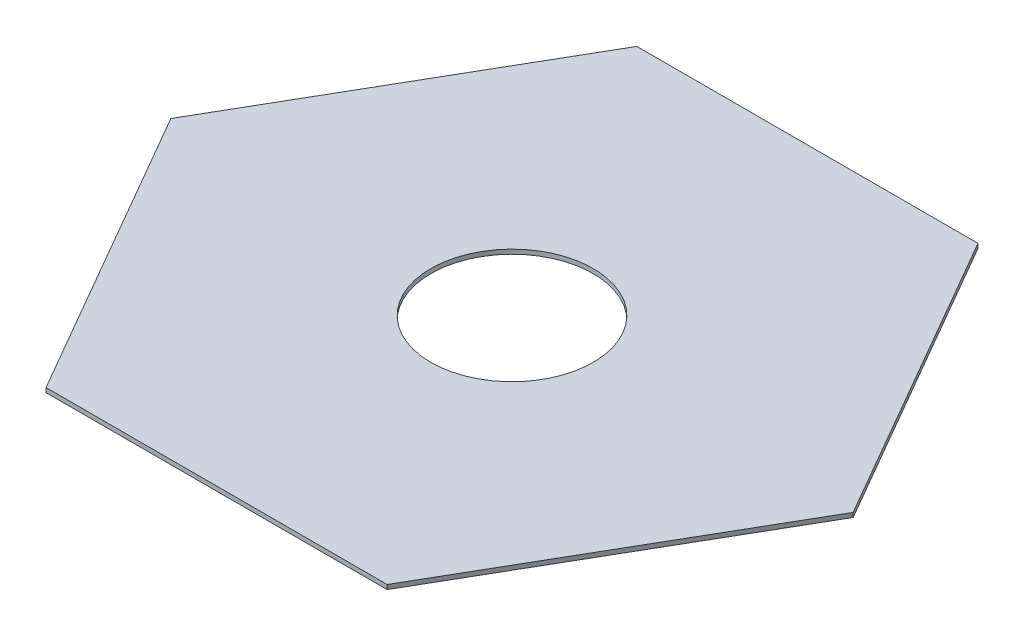
ISO-10303-21;
HEADER;
FILE_DESCRIPTION(('STEP AP214'),'2;1');
FILE_NAME('part.step','',(''),(''),'','','');
FILE_SCHEMA(('AUTOMOTIVE_DESIGN { 1 0 10303 214 1 1 1 1 }'));
ENDSEC;
DATA;
#1=APPLICATION_CONTEXT('core data for automotive mechanical design processes');
#2=APPLICATION_PROTOCOL_DEFINITION('international standard','automotive_design',2000,#1);
#3=PRODUCT_CONTEXT('',#1,'mechanical');
#4=PRODUCT('Part','Part','',(#3));
#5=PRODUCT_RELATED_PRODUCT_CATEGORY('part','',(#4));
#6=PRODUCT_DEFINITION_FORMATION('','',#4);
#7=PRODUCT_DEFINITION_CONTEXT('part definition',#1,'design');
#8=PRODUCT_DEFINITION('design','',#6,#7);
#9=PRODUCT_DEFINITION_SHAPE('','',#8);
#10=(LENGTH_UNIT() NAMED_UNIT(*) SI_UNIT(.MILLI.,.METRE.));
#11=(NAMED_UNIT(*) PLANE_ANGLE_UNIT() SI_UNIT($,.RADIAN.));
#12=(NAMED_UNIT(*) SI_UNIT($,.STERADIAN.) SOLID_ANGLE_UNIT());
#13=UNCERTAINTY_MEASURE_WITH_UNIT(LENGTH_MEASURE(1.E-05),#10,'distance_accuracy_value','');
#14=(GEOMETRIC_REPRESENTATION_CONTEXT(3) GLOBAL_UNCERTAINTY_ASSIGNED_CONTEXT((#13)) GLOBAL_UNIT_ASSIGNED_CONTEXT((#10,
#11,#12)) REPRESENTATION_CONTEXT('',''));
#15=CARTESIAN_POINT('',(0.,0.,0.));
#16=DIRECTION('',(0.,0.,1.));
#17=DIRECTION('',(1.,0.,0.));
#18=AXIS2_PLACEMENT_3D('',#15,#16,#17);
#19=CARTESIAN_POINT('',(0.,3.,0.));
#20=DIRECTION('',(0.,1.,0.));
#21=DIRECTION('',(0.,0.,1.));
#22=AXIS2_PLACEMENT_3D('',#19,#20,#21);
#23=PLANE('',#22);
#24=DIRECTION('',(1.,0.,0.));
#25=VECTOR('',#24,1.);
#26=CARTESIAN_POINT('',(-115.470053837925,3.,200.));
#27=LINE('',#26,#25);
#28=CARTESIAN_POINT('',(-115.470053837925,3.,200.));
#29=VERTEX_POINT('',#28);
#30=CARTESIAN_POINT('',(115.470053837925,3.,200.));
#31=VERTEX_POINT('',#30);
#32=EDGE_CURVE('E129',#29,#31,#27,.T.);
#33=ORIENTED_EDGE('',*,*,#32,.T.);
#34=DIRECTION('',(0.5,0.,-0.866025403784439));
#35=VECTOR('',#34,1.);
#36=CARTESIAN_POINT('',(115.470053837925,3.,200.));
#37=LINE('',#36,#35);
#38=CARTESIAN_POINT('',(230.94010767585,3.,0.));
#39=VERTEX_POINT('',#38);
#40=EDGE_CURVE('E87',#31,#39,#37,.T.);
#41=ORIENTED_EDGE('',*,*,#40,.T.);
#42=DIRECTION('',(-0.5,0.,-0.866025403784438));
#43=VECTOR('',#42,1.);
#44=CARTESIAN_POINT('',(230.94010767585,3.,0.));
#45=LINE('',#44,#43);
#46=CARTESIAN_POINT('',(115.470053837925,3.,-200.));
#47=VERTEX_POINT('',#46);
#48=EDGE_CURVE('E100',#39,#47,#45,.T.);
#49=ORIENTED_EDGE('',*,*,#48,.T.);
#50=DIRECTION('',(-1.,0.,0.));
#51=VECTOR('',#50,1.);
#52=CARTESIAN_POINT('',(115.470053837925,3.,-200.));
#53=LINE('',#52,#51);
#54=CARTESIAN_POINT('',(-115.470053837925,3.,-200.));
#55=VERTEX_POINT('',#54);
#56=EDGE_CURVE('E94',#47,#55,#53,.T.);
#57=ORIENTED_EDGE('',*,*,#56,.T.);
#58=DIRECTION('',(-0.5,0.,0.866025403784439));
#59=VECTOR('',#58,1.);
#60=CARTESIAN_POINT('',(-115.470053837925,3.,-200.));
#61=LINE('',#60,#59);
#62=CARTESIAN_POINT('',(-230.94010767585,3.,0.));
#63=VERTEX_POINT('',#62);
#64=EDGE_CURVE('E98',#55,#63,#61,.T.);
#65=ORIENTED_EDGE('',*,*,#64,.T.);
#66=DIRECTION('',(0.5,0.,0.866025403784439));
#67=VECTOR('',#66,1.);
#68=CARTESIAN_POINT('',(-230.94010767585,3.,0.));
#69=LINE('',#68,#67);
#70=EDGE_CURVE('E50',#63,#29,#69,.T.);
#71=ORIENTED_EDGE('',*,*,#70,.T.);
#72=EDGE_LOOP('',(#33,#41,#49,#57,#65,#71));
#73=FACE_BOUND('',#72,.T.);
#74=CARTESIAN_POINT('',(0.,3.,0.));
#75=DIRECTION('',(0.,1.,0.));
#76=DIRECTION('',(0.,0.,1.));
#77=AXIS2_PLACEMENT_3D('',#74,#75,#76);
#78=CIRCLE('',#77,55.);
#79=CARTESIAN_POINT('',(0.,3.,55.));
#80=VERTEX_POINT('',#79);
#81=EDGE_CURVE('E122',#80,#80,#78,.T.);
#82=ORIENTED_EDGE('',*,*,#81,.F.);
#83=EDGE_LOOP('',(#82));
#84=FACE_BOUND('',#83,.T.);
#85=ADVANCED_FACE('F33',(#73,#84),#23,.T.);
#86=CARTESIAN_POINT('',(0.,0.,0.));
#87=DIRECTION('',(0.,1.,0.));
#88=DIRECTION('',(0.,0.,1.));
#89=AXIS2_PLACEMENT_3D('',#86,#87,#88);
#90=PLANE('',#89);
#91=DIRECTION('',(1.,0.,0.));
#92=VECTOR('',#91,1.);
#93=CARTESIAN_POINT('',(-115.470053837925,0.,200.));
#94=LINE('',#93,#92);
#95=CARTESIAN_POINT('',(-115.470053837925,0.,200.));
#96=VERTEX_POINT('',#95);
#97=CARTESIAN_POINT('',(115.470053837925,0.,200.));
#98=VERTEX_POINT('',#97);
#99=EDGE_CURVE('E118',#96,#98,#94,.T.);
#100=ORIENTED_EDGE('',*,*,#99,.F.);
#101=DIRECTION('',(0.5,0.,0.866025403784439));
#102=VECTOR('',#101,1.);
#103=CARTESIAN_POINT('',(-230.94010767585,0.,0.));
#104=LINE('',#103,#102);
#105=CARTESIAN_POINT('',(-230.94010767585,0.,0.));
#106=VERTEX_POINT('',#105);
#107=EDGE_CURVE('E79',#106,#96,#104,.T.);
#108=ORIENTED_EDGE('',*,*,#107,.F.);
#109=DIRECTION('',(-0.5,0.,0.866025403784439));
#110=VECTOR('',#109,1.);
#111=CARTESIAN_POINT('',(-115.470053837925,0.,-200.));
#112=LINE('',#111,#110);
#113=CARTESIAN_POINT('',(-115.470053837925,0.,-200.));
#114=VERTEX_POINT('',#113);
#115=EDGE_CURVE('E73',#114,#106,#112,.T.);
#116=ORIENTED_EDGE('',*,*,#115,.F.);
#117=DIRECTION('',(-1.,0.,0.));
#118=VECTOR('',#117,1.);
#119=CARTESIAN_POINT('',(115.470053837925,0.,-200.));
#120=LINE('',#119,#118);
#121=CARTESIAN_POINT('',(115.470053837925,0.,-200.));
#122=VERTEX_POINT('',#121);
#123=EDGE_CURVE('E108',#122,#114,#120,.T.);
#124=ORIENTED_EDGE('',*,*,#123,.F.);
#125=DIRECTION('',(-0.5,0.,-0.866025403784438));
#126=VECTOR('',#125,1.);
#127=CARTESIAN_POINT('',(230.94010767585,0.,0.));
#128=LINE('',#127,#126);
#129=CARTESIAN_POINT('',(230.94010767585,0.,0.));
#130=VERTEX_POINT('',#129);
#131=EDGE_CURVE('E124',#130,#122,#128,.T.);
#132=ORIENTED_EDGE('',*,*,#131,.F.);
#133=DIRECTION('',(0.5,0.,-0.866025403784439));
#134=VECTOR('',#133,1.);
#135=CARTESIAN_POINT('',(115.470053837925,0.,200.));
#136=LINE('',#135,#134);
#137=EDGE_CURVE('E121',#98,#130,#136,.T.);
#138=ORIENTED_EDGE('',*,*,#137,.F.);
#139=EDGE_LOOP('',(#100,#108,#116,#124,#132,#138));
#140=FACE_BOUND('',#139,.T.);
#141=CARTESIAN_POINT('',(0.,0.,0.));
#142=DIRECTION('',(0.,1.,0.));
#143=DIRECTION('',(0.,0.,1.));
#144=AXIS2_PLACEMENT_3D('',#141,#142,#143);
#145=CIRCLE('',#144,55.);
#146=CARTESIAN_POINT('',(0.,0.,55.));
#147=VERTEX_POINT('',#146);
#148=EDGE_CURVE('E222',#147,#147,#145,.T.);
#149=ORIENTED_EDGE('',*,*,#148,.T.);
#150=EDGE_LOOP('',(#149));
#151=FACE_BOUND('',#150,.T.);
#152=ADVANCED_FACE('F138',(#140,#151),#90,.F.);
#153=CARTESIAN_POINT('',(-115.470053837925,3.,200.));
#154=DIRECTION('',(0.,0.,-1.));
#155=DIRECTION('',(-1.,0.,0.));
#156=AXIS2_PLACEMENT_3D('',#153,#154,#155);
#157=PLANE('',#156);
#158=ORIENTED_EDGE('',*,*,#99,.T.);
#159=DIRECTION('',(0.,-1.,0.));
#160=VECTOR('',#159,1.);
#161=CARTESIAN_POINT('',(115.470053837925,3.,200.));
#162=LINE('',#161,#160);
#163=EDGE_CURVE('E11',#31,#98,#162,.T.);
#164=ORIENTED_EDGE('',*,*,#163,.F.);
#165=ORIENTED_EDGE('',*,*,#32,.F.);
#166=DIRECTION('',(0.,-1.,0.));
#167=VECTOR('',#166,1.);
#168=CARTESIAN_POINT('',(-115.470053837925,3.,200.));
#169=LINE('',#168,#167);
#170=EDGE_CURVE('E114',#29,#96,#169,.T.);
#171=ORIENTED_EDGE('',*,*,#170,.T.);
#172=EDGE_LOOP('',(#158,#164,#165,#171));
#173=FACE_BOUND('',#172,.T.);
#174=ADVANCED_FACE('F35',(#173),#157,.F.);
#175=CARTESIAN_POINT('',(115.470053837925,3.,200.));
#176=DIRECTION('',(-0.866025403784439,0.,-0.5));
#177=DIRECTION('',(-0.5,0.,0.866025403784439));
#178=AXIS2_PLACEMENT_3D('',#175,#176,#177);
#179=PLANE('',#178);
#180=ORIENTED_EDGE('',*,*,#137,.T.);
#181=DIRECTION('',(0.,-1.,0.));
#182=VECTOR('',#181,1.);
#183=CARTESIAN_POINT('',(230.94010767585,3.,0.));
#184=LINE('',#183,#182);
#185=EDGE_CURVE('E42',#39,#130,#184,.T.);
#186=ORIENTED_EDGE('',*,*,#185,.F.);
#187=ORIENTED_EDGE('',*,*,#40,.F.);
#188=ORIENTED_EDGE('',*,*,#163,.T.);
#189=EDGE_LOOP('',(#180,#186,#187,#188));
#190=FACE_BOUND('',#189,.T.);
#191=ADVANCED_FACE('F163',(#190),#179,.F.);
#192=CARTESIAN_POINT('',(230.94010767585,3.,0.));
#193=DIRECTION('',(-0.866025403784438,0.,0.5));
#194=DIRECTION('',(0.5,0.,0.866025403784438));
#195=AXIS2_PLACEMENT_3D('',#192,#193,#194);
#196=PLANE('',#195);
#197=ORIENTED_EDGE('',*,*,#131,.T.);
#198=DIRECTION('',(0.,-1.,0.));
#199=VECTOR('',#198,1.);
#200=CARTESIAN_POINT('',(115.470053837925,3.,-200.));
#201=LINE('',#200,#199);
#202=EDGE_CURVE('E109',#47,#122,#201,.T.);
#203=ORIENTED_EDGE('',*,*,#202,.F.);
#204=ORIENTED_EDGE('',*,*,#48,.F.);
#205=ORIENTED_EDGE('',*,*,#185,.T.);
#206=EDGE_LOOP('',(#197,#203,#204,#205));
#207=FACE_BOUND('',#206,.T.);
#208=ADVANCED_FACE('F135',(#207),#196,.F.);
#209=CARTESIAN_POINT('',(115.470053837925,3.,-200.));
#210=DIRECTION('',(0.,0.,1.));
#211=DIRECTION('',(1.,0.,0.));
#212=AXIS2_PLACEMENT_3D('',#209,#210,#211);
#213=PLANE('',#212);
#214=ORIENTED_EDGE('',*,*,#123,.T.);
#215=DIRECTION('',(0.,-1.,0.));
#216=VECTOR('',#215,1.);
#217=CARTESIAN_POINT('',(-115.470053837925,3.,-200.));
#218=LINE('',#217,#216);
#219=EDGE_CURVE('E105',#55,#114,#218,.T.);
#220=ORIENTED_EDGE('',*,*,#219,.F.);
#221=ORIENTED_EDGE('',*,*,#56,.F.);
#222=ORIENTED_EDGE('',*,*,#202,.T.);
#223=EDGE_LOOP('',(#214,#220,#221,#222));
#224=FACE_BOUND('',#223,.T.);
#225=ADVANCED_FACE('F106',(#224),#213,.F.);
#226=CARTESIAN_POINT('',(-115.470053837925,3.,-200.));
#227=DIRECTION('',(0.866025403784438,0.,0.5));
#228=DIRECTION('',(0.5,0.,-0.866025403784439));
#229=AXIS2_PLACEMENT_3D('',#226,#227,#228);
#230=PLANE('',#229);
#231=ORIENTED_EDGE('',*,*,#115,.T.);
#232=DIRECTION('',(0.,-1.,0.));
#233=VECTOR('',#232,1.);
#234=CARTESIAN_POINT('',(-230.94010767585,3.,0.));
#235=LINE('',#234,#233);
#236=EDGE_CURVE('E110',#63,#106,#235,.T.);
#237=ORIENTED_EDGE('',*,*,#236,.F.);
#238=ORIENTED_EDGE('',*,*,#64,.F.);
#239=ORIENTED_EDGE('',*,*,#219,.T.);
#240=EDGE_LOOP('',(#231,#237,#238,#239));
#241=FACE_BOUND('',#240,.T.);
#242=ADVANCED_FACE('F112',(#241),#230,.F.);
#243=CARTESIAN_POINT('',(-230.94010767585,3.,0.));
#244=DIRECTION('',(0.866025403784438,0.,-0.5));
#245=DIRECTION('',(-0.5,0.,-0.866025403784439));
#246=AXIS2_PLACEMENT_3D('',#243,#244,#245);
#247=PLANE('',#246);
#248=ORIENTED_EDGE('',*,*,#107,.T.);
#249=ORIENTED_EDGE('',*,*,#170,.F.);
#250=ORIENTED_EDGE('',*,*,#70,.F.);
#251=ORIENTED_EDGE('',*,*,#236,.T.);
#252=EDGE_LOOP('',(#248,#249,#250,#251));
#253=FACE_BOUND('',#252,.T.);
#254=ADVANCED_FACE('F143',(#253),#247,.F.);
#255=CARTESIAN_POINT('',(0.,3.,0.));
#256=DIRECTION('',(0.,-1.,0.));
#257=DIRECTION('',(0.,0.,-1.));
#258=AXIS2_PLACEMENT_3D('',#255,#256,#257);
#259=CYLINDRICAL_SURFACE('',#258,55.);
#260=ORIENTED_EDGE('',*,*,#81,.T.);
#261=EDGE_LOOP('',(#260));
#262=FACE_BOUND('',#261,.T.);
#263=ORIENTED_EDGE('',*,*,#148,.F.);
#264=EDGE_LOOP('',(#263));
#265=FACE_BOUND('',#264,.T.);
#266=ADVANCED_FACE('F145',(#262,#265),#259,.F.);
#267=CLOSED_SHELL('',(#85,#152,#174,#191,#208,#225,#242,#254,#266));
#268=MANIFOLD_SOLID_BREP('B2',#267);
#269=ADVANCED_BREP_SHAPE_REPRESENTATION('',(#18,#268),#14);
#270=SHAPE_DEFINITION_REPRESENTATION(#9,#269);
ENDSEC;
END-ISO-10303-21;
